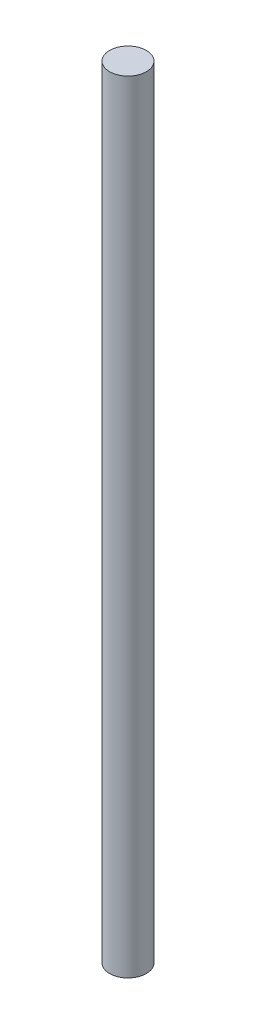
ISO-10303-21;
HEADER;
FILE_DESCRIPTION(('STEP AP214'),'2;1');
FILE_NAME('part.step','',(''),(''),'','','');
FILE_SCHEMA(('AUTOMOTIVE_DESIGN { 1 0 10303 214 1 1 1 1 }'));
ENDSEC;
DATA;
#1=APPLICATION_CONTEXT('core data for automotive mechanical design processes');
#2=APPLICATION_PROTOCOL_DEFINITION('international standard','automotive_design',2000,#1);
#3=PRODUCT_CONTEXT('',#1,'mechanical');
#4=PRODUCT('Part','Part','',(#3));
#5=PRODUCT_RELATED_PRODUCT_CATEGORY('part','',(#4));
#6=PRODUCT_DEFINITION_FORMATION('','',#4);
#7=PRODUCT_DEFINITION_CONTEXT('part definition',#1,'design');
#8=PRODUCT_DEFINITION('design','',#6,#7);
#9=PRODUCT_DEFINITION_SHAPE('','',#8);
#10=(LENGTH_UNIT() NAMED_UNIT(*) SI_UNIT(.MILLI.,.METRE.));
#11=(NAMED_UNIT(*) PLANE_ANGLE_UNIT() SI_UNIT($,.RADIAN.));
#12=(NAMED_UNIT(*) SI_UNIT($,.STERADIAN.) SOLID_ANGLE_UNIT());
#13=UNCERTAINTY_MEASURE_WITH_UNIT(LENGTH_MEASURE(1.E-05),#10,'distance_accuracy_value','');
#14=(GEOMETRIC_REPRESENTATION_CONTEXT(3) GLOBAL_UNCERTAINTY_ASSIGNED_CONTEXT((#13)) GLOBAL_UNIT_ASSIGNED_CONTEXT((#10,
#11,#12)) REPRESENTATION_CONTEXT('',''));
#15=CARTESIAN_POINT('',(0.,0.,0.));
#16=DIRECTION('',(0.,0.,1.));
#17=DIRECTION('',(1.,0.,0.));
#18=AXIS2_PLACEMENT_3D('',#15,#16,#17);
#19=CARTESIAN_POINT('',(0.,15.9,0.));
#20=DIRECTION('',(0.,-1.,0.));
#21=DIRECTION('',(0.,0.,-1.));
#22=AXIS2_PLACEMENT_3D('',#19,#20,#21);
#23=CYLINDRICAL_SURFACE('',#22,0.75);
#24=CARTESIAN_POINT('',(0.,15.9,0.));
#25=DIRECTION('',(0.,1.,0.));
#26=DIRECTION('',(0.,0.,1.));
#27=AXIS2_PLACEMENT_3D('',#24,#25,#26);
#28=CIRCLE('',#27,0.75);
#29=CARTESIAN_POINT('',(0.,15.9,0.75));
#30=VERTEX_POINT('',#29);
#31=EDGE_CURVE('E10',#30,#30,#28,.T.);
#32=ORIENTED_EDGE('',*,*,#31,.F.);
#33=EDGE_LOOP('',(#32));
#34=FACE_BOUND('',#33,.T.);
#35=CARTESIAN_POINT('',(0.,-15.9,0.));
#36=DIRECTION('',(0.,1.,0.));
#37=DIRECTION('',(0.,0.,1.));
#38=AXIS2_PLACEMENT_3D('',#35,#36,#37);
#39=CIRCLE('',#38,0.75);
#40=CARTESIAN_POINT('',(0.,-15.9,0.75));
#41=VERTEX_POINT('',#40);
#42=EDGE_CURVE('E40',#41,#41,#39,.T.);
#43=ORIENTED_EDGE('',*,*,#42,.T.);
#44=EDGE_LOOP('',(#43));
#45=FACE_BOUND('',#44,.T.);
#46=ADVANCED_FACE('F37',(#34,#45),#23,.T.);
#47=CARTESIAN_POINT('',(0.,15.9,0.));
#48=DIRECTION('',(0.,1.,0.));
#49=DIRECTION('',(0.,0.,1.));
#50=AXIS2_PLACEMENT_3D('',#47,#48,#49);
#51=PLANE('',#50);
#52=ORIENTED_EDGE('',*,*,#31,.T.);
#53=EDGE_LOOP('',(#52));
#54=FACE_BOUND('',#53,.T.);
#55=ADVANCED_FACE('F54',(#54),#51,.T.);
#56=CARTESIAN_POINT('',(0.,-15.9,0.));
#57=DIRECTION('',(0.,1.,0.));
#58=DIRECTION('',(0.,0.,1.));
#59=AXIS2_PLACEMENT_3D('',#56,#57,#58);
#60=PLANE('',#59);
#61=ORIENTED_EDGE('',*,*,#42,.F.);
#62=EDGE_LOOP('',(#61));
#63=FACE_BOUND('',#62,.T.);
#64=ADVANCED_FACE('F52',(#63),#60,.F.);
#65=CLOSED_SHELL('',(#46,#55,#64));
#66=MANIFOLD_SOLID_BREP('B2',#65);
#67=ADVANCED_BREP_SHAPE_REPRESENTATION('',(#18,#66),#14);
#68=SHAPE_DEFINITION_REPRESENTATION(#9,#67);
ENDSEC;
END-ISO-10303-21;
